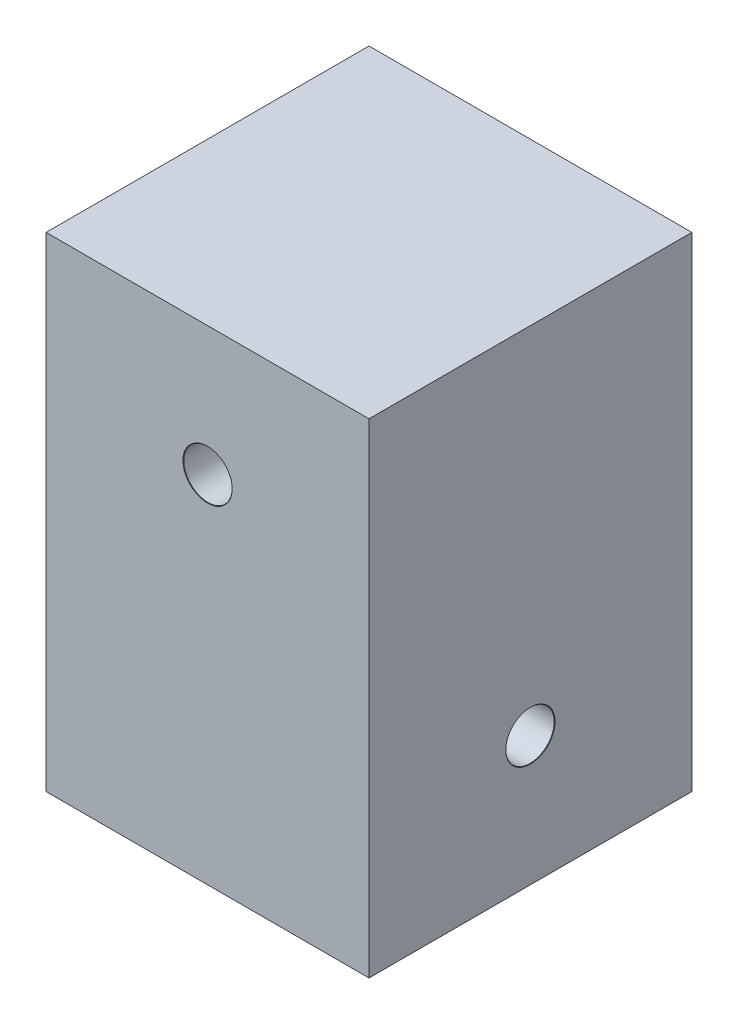
ISO-10303-21;
HEADER;
FILE_DESCRIPTION(('STEP AP214'),'2;1');
FILE_NAME('part.step','',(''),(''),'','','');
FILE_SCHEMA(('AUTOMOTIVE_DESIGN { 1 0 10303 214 1 1 1 1 }'));
ENDSEC;
DATA;
#1=APPLICATION_CONTEXT('core data for automotive mechanical design processes');
#2=APPLICATION_PROTOCOL_DEFINITION('international standard','automotive_design',2000,#1);
#3=PRODUCT_CONTEXT('',#1,'mechanical');
#4=PRODUCT('Part','Part','',(#3));
#5=PRODUCT_RELATED_PRODUCT_CATEGORY('part','',(#4));
#6=PRODUCT_DEFINITION_FORMATION('','',#4);
#7=PRODUCT_DEFINITION_CONTEXT('part definition',#1,'design');
#8=PRODUCT_DEFINITION('design','',#6,#7);
#9=PRODUCT_DEFINITION_SHAPE('','',#8);
#10=(LENGTH_UNIT() NAMED_UNIT(*) SI_UNIT(.MILLI.,.METRE.));
#11=(NAMED_UNIT(*) PLANE_ANGLE_UNIT() SI_UNIT($,.RADIAN.));
#12=(NAMED_UNIT(*) SI_UNIT($,.STERADIAN.) SOLID_ANGLE_UNIT());
#13=UNCERTAINTY_MEASURE_WITH_UNIT(LENGTH_MEASURE(1.E-05),#10,'distance_accuracy_value','');
#14=(GEOMETRIC_REPRESENTATION_CONTEXT(3) GLOBAL_UNCERTAINTY_ASSIGNED_CONTEXT((#13)) GLOBAL_UNIT_ASSIGNED_CONTEXT((#10,
#11,#12)) REPRESENTATION_CONTEXT('',''));
#15=CARTESIAN_POINT('',(0.,0.,0.));
#16=DIRECTION('',(0.,0.,1.));
#17=DIRECTION('',(1.,0.,0.));
#18=AXIS2_PLACEMENT_3D('',#15,#16,#17);
#19=CARTESIAN_POINT('',(0.,30.,0.));
#20=DIRECTION('',(1.,0.,0.));
#21=DIRECTION('',(0.,0.,-1.));
#22=AXIS2_PLACEMENT_3D('',#19,#20,#21);
#23=PLANE('',#22);
#24=CARTESIAN_POINT('',(0.,8.,10.));
#25=DIRECTION('',(1.,0.,0.));
#26=DIRECTION('',(0.,0.,-1.));
#27=AXIS2_PLACEMENT_3D('',#24,#25,#26);
#28=CIRCLE('',#27,1.49999999999999);
#29=CARTESIAN_POINT('',(0.,8.,8.50000000000001));
#30=VERTEX_POINT('',#29);
#31=EDGE_CURVE('E99',#30,#30,#28,.T.);
#32=ORIENTED_EDGE('',*,*,#31,.T.);
#33=EDGE_LOOP('',(#32));
#34=FACE_BOUND('',#33,.T.);
#35=DIRECTION('',(0.,0.,1.));
#36=VECTOR('',#35,1.);
#37=CARTESIAN_POINT('',(0.,0.,0.));
#38=LINE('',#37,#36);
#39=CARTESIAN_POINT('',(0.,0.,0.));
#40=VERTEX_POINT('',#39);
#41=CARTESIAN_POINT('',(0.,0.,20.));
#42=VERTEX_POINT('',#41);
#43=EDGE_CURVE('E96',#40,#42,#38,.T.);
#44=ORIENTED_EDGE('',*,*,#43,.T.);
#45=DIRECTION('',(0.,-1.,0.));
#46=VECTOR('',#45,1.);
#47=CARTESIAN_POINT('',(0.,30.,20.));
#48=LINE('',#47,#46);
#49=CARTESIAN_POINT('',(0.,30.,20.));
#50=VERTEX_POINT('',#49);
#51=EDGE_CURVE('E11',#50,#42,#48,.T.);
#52=ORIENTED_EDGE('',*,*,#51,.F.);
#53=DIRECTION('',(0.,0.,1.));
#54=VECTOR('',#53,1.);
#55=CARTESIAN_POINT('',(0.,30.,0.));
#56=LINE('',#55,#54);
#57=CARTESIAN_POINT('',(0.,30.,0.));
#58=VERTEX_POINT('',#57);
#59=EDGE_CURVE('E84',#58,#50,#56,.T.);
#60=ORIENTED_EDGE('',*,*,#59,.F.);
#61=DIRECTION('',(0.,-1.,0.));
#62=VECTOR('',#61,1.);
#63=CARTESIAN_POINT('',(0.,30.,0.));
#64=LINE('',#63,#62);
#65=EDGE_CURVE('E92',#58,#40,#64,.T.);
#66=ORIENTED_EDGE('',*,*,#65,.T.);
#67=EDGE_LOOP('',(#44,#52,#60,#66));
#68=FACE_BOUND('',#67,.T.);
#69=ADVANCED_FACE('F33',(#34,#68),#23,.F.);
#70=CARTESIAN_POINT('',(0.,30.,20.));
#71=DIRECTION('',(0.,0.,-1.));
#72=DIRECTION('',(-1.,0.,0.));
#73=AXIS2_PLACEMENT_3D('',#70,#71,#72);
#74=PLANE('',#73);
#75=CARTESIAN_POINT('',(10.,22.,20.));
#76=DIRECTION('',(0.,0.,1.));
#77=DIRECTION('',(1.,0.,0.));
#78=AXIS2_PLACEMENT_3D('',#75,#76,#77);
#79=CIRCLE('',#78,1.525);
#80=CARTESIAN_POINT('',(11.525,22.,20.));
#81=VERTEX_POINT('',#80);
#82=EDGE_CURVE('E124',#81,#81,#79,.T.);
#83=ORIENTED_EDGE('',*,*,#82,.F.);
#84=EDGE_LOOP('',(#83));
#85=FACE_BOUND('',#84,.T.);
#86=DIRECTION('',(1.,0.,0.));
#87=VECTOR('',#86,1.);
#88=CARTESIAN_POINT('',(0.,0.,20.));
#89=LINE('',#88,#87);
#90=CARTESIAN_POINT('',(20.,0.,20.));
#91=VERTEX_POINT('',#90);
#92=EDGE_CURVE('E88',#42,#91,#89,.T.);
#93=ORIENTED_EDGE('',*,*,#92,.T.);
#94=DIRECTION('',(0.,-1.,0.));
#95=VECTOR('',#94,1.);
#96=CARTESIAN_POINT('',(20.,30.,20.));
#97=LINE('',#96,#95);
#98=CARTESIAN_POINT('',(20.,30.,20.));
#99=VERTEX_POINT('',#98);
#100=EDGE_CURVE('E41',#99,#91,#97,.T.);
#101=ORIENTED_EDGE('',*,*,#100,.F.);
#102=DIRECTION('',(1.,0.,0.));
#103=VECTOR('',#102,1.);
#104=CARTESIAN_POINT('',(0.,30.,20.));
#105=LINE('',#104,#103);
#106=EDGE_CURVE('E79',#50,#99,#105,.T.);
#107=ORIENTED_EDGE('',*,*,#106,.F.);
#108=ORIENTED_EDGE('',*,*,#51,.T.);
#109=EDGE_LOOP('',(#93,#101,#107,#108));
#110=FACE_BOUND('',#109,.T.);
#111=ADVANCED_FACE('F87',(#85,#110),#74,.F.);
#112=CARTESIAN_POINT('',(20.,30.,0.));
#113=DIRECTION('',(-1.,0.,0.));
#114=DIRECTION('',(0.,0.,1.));
#115=AXIS2_PLACEMENT_3D('',#112,#113,#114);
#116=PLANE('',#115);
#117=CARTESIAN_POINT('',(20.,8.,10.));
#118=DIRECTION('',(1.,0.,0.));
#119=DIRECTION('',(0.,0.,-1.));
#120=AXIS2_PLACEMENT_3D('',#117,#118,#119);
#121=CIRCLE('',#120,1.525);
#122=CARTESIAN_POINT('',(20.,8.,8.475));
#123=VERTEX_POINT('',#122);
#124=EDGE_CURVE('E115',#123,#123,#121,.T.);
#125=ORIENTED_EDGE('',*,*,#124,.F.);
#126=EDGE_LOOP('',(#125));
#127=FACE_BOUND('',#126,.T.);
#128=DIRECTION('',(0.,0.,-1.));
#129=VECTOR('',#128,1.);
#130=CARTESIAN_POINT('',(20.,0.,0.));
#131=LINE('',#130,#129);
#132=CARTESIAN_POINT('',(20.,0.,0.));
#133=VERTEX_POINT('',#132);
#134=EDGE_CURVE('E66',#91,#133,#131,.T.);
#135=ORIENTED_EDGE('',*,*,#134,.T.);
#136=DIRECTION('',(0.,-1.,0.));
#137=VECTOR('',#136,1.);
#138=CARTESIAN_POINT('',(20.,30.,0.));
#139=LINE('',#138,#137);
#140=CARTESIAN_POINT('',(20.,30.,0.));
#141=VERTEX_POINT('',#140);
#142=EDGE_CURVE('E89',#141,#133,#139,.T.);
#143=ORIENTED_EDGE('',*,*,#142,.F.);
#144=DIRECTION('',(0.,0.,-1.));
#145=VECTOR('',#144,1.);
#146=CARTESIAN_POINT('',(20.,30.,0.));
#147=LINE('',#146,#145);
#148=EDGE_CURVE('E82',#99,#141,#147,.T.);
#149=ORIENTED_EDGE('',*,*,#148,.F.);
#150=ORIENTED_EDGE('',*,*,#100,.T.);
#151=EDGE_LOOP('',(#135,#143,#149,#150));
#152=FACE_BOUND('',#151,.T.);
#153=ADVANCED_FACE('F90',(#127,#152),#116,.F.);
#154=CARTESIAN_POINT('',(0.,30.,0.));
#155=DIRECTION('',(0.,0.,1.));
#156=DIRECTION('',(1.,0.,0.));
#157=AXIS2_PLACEMENT_3D('',#154,#155,#156);
#158=PLANE('',#157);
#159=CARTESIAN_POINT('',(10.,22.,0.));
#160=DIRECTION('',(0.,0.,1.));
#161=DIRECTION('',(1.,0.,0.));
#162=AXIS2_PLACEMENT_3D('',#159,#160,#161);
#163=CIRCLE('',#162,1.49999999999999);
#164=CARTESIAN_POINT('',(11.5,22.,0.));
#165=VERTEX_POINT('',#164);
#166=EDGE_CURVE('E118',#165,#165,#163,.T.);
#167=ORIENTED_EDGE('',*,*,#166,.T.);
#168=EDGE_LOOP('',(#167));
#169=FACE_BOUND('',#168,.T.);
#170=DIRECTION('',(-1.,0.,0.));
#171=VECTOR('',#170,1.);
#172=CARTESIAN_POINT('',(0.,0.,0.));
#173=LINE('',#172,#171);
#174=EDGE_CURVE('E72',#133,#40,#173,.T.);
#175=ORIENTED_EDGE('',*,*,#174,.T.);
#176=ORIENTED_EDGE('',*,*,#65,.F.);
#177=DIRECTION('',(-1.,0.,0.));
#178=VECTOR('',#177,1.);
#179=CARTESIAN_POINT('',(0.,30.,0.));
#180=LINE('',#179,#178);
#181=EDGE_CURVE('E49',#141,#58,#180,.T.);
#182=ORIENTED_EDGE('',*,*,#181,.F.);
#183=ORIENTED_EDGE('',*,*,#142,.T.);
#184=EDGE_LOOP('',(#175,#176,#182,#183));
#185=FACE_BOUND('',#184,.T.);
#186=ADVANCED_FACE('F104',(#169,#185),#158,.F.);
#187=CARTESIAN_POINT('',(0.,30.,0.));
#188=DIRECTION('',(0.,1.,0.));
#189=DIRECTION('',(0.,0.,1.));
#190=AXIS2_PLACEMENT_3D('',#187,#188,#189);
#191=PLANE('',#190);
#192=ORIENTED_EDGE('',*,*,#59,.T.);
#193=ORIENTED_EDGE('',*,*,#106,.T.);
#194=ORIENTED_EDGE('',*,*,#148,.T.);
#195=ORIENTED_EDGE('',*,*,#181,.T.);
#196=EDGE_LOOP('',(#192,#193,#194,#195));
#197=FACE_BOUND('',#196,.T.);
#198=ADVANCED_FACE('F80',(#197),#191,.T.);
#199=CARTESIAN_POINT('',(0.,0.,0.));
#200=DIRECTION('',(0.,1.,0.));
#201=DIRECTION('',(0.,0.,1.));
#202=AXIS2_PLACEMENT_3D('',#199,#200,#201);
#203=PLANE('',#202);
#204=ORIENTED_EDGE('',*,*,#43,.F.);
#205=ORIENTED_EDGE('',*,*,#174,.F.);
#206=ORIENTED_EDGE('',*,*,#134,.F.);
#207=ORIENTED_EDGE('',*,*,#92,.F.);
#208=EDGE_LOOP('',(#204,#205,#206,#207));
#209=FACE_BOUND('',#208,.T.);
#210=ADVANCED_FACE('F107',(#209),#203,.F.);
#211=CARTESIAN_POINT('',(20.,8.,10.));
#212=DIRECTION('',(1.,0.,0.));
#213=DIRECTION('',(0.,0.,-1.));
#214=AXIS2_PLACEMENT_3D('',#211,#212,#213);
#215=CYLINDRICAL_SURFACE('',#214,1.49999999999999);
#216=ORIENTED_EDGE('',*,*,#31,.F.);
#217=EDGE_LOOP('',(#216));
#218=FACE_BOUND('',#217,.T.);
#219=CARTESIAN_POINT('',(19.975,8.,10.));
#220=DIRECTION('',(1.,0.,0.));
#221=DIRECTION('',(0.,0.,-1.));
#222=AXIS2_PLACEMENT_3D('',#219,#220,#221);
#223=CIRCLE('',#222,1.49999999999999);
#224=CARTESIAN_POINT('',(19.975,8.,8.50000000000001));
#225=VERTEX_POINT('',#224);
#226=EDGE_CURVE('E112',#225,#225,#223,.T.);
#227=ORIENTED_EDGE('',*,*,#226,.T.);
#228=EDGE_LOOP('',(#227));
#229=FACE_BOUND('',#228,.T.);
#230=ADVANCED_FACE('F144',(#218,#229),#215,.F.);
#231=CARTESIAN_POINT('',(20.,8.,10.));
#232=DIRECTION('',(1.,0.,0.));
#233=DIRECTION('',(0.,0.,-1.));
#234=AXIS2_PLACEMENT_3D('',#231,#232,#233);
#235=CONICAL_SURFACE('',#234,1.525,0.785398163397379);
#236=ORIENTED_EDGE('',*,*,#226,.F.);
#237=EDGE_LOOP('',(#236));
#238=FACE_BOUND('',#237,.T.);
#239=ORIENTED_EDGE('',*,*,#124,.T.);
#240=EDGE_LOOP('',(#239));
#241=FACE_BOUND('',#240,.T.);
#242=ADVANCED_FACE('F149',(#238,#241),#235,.F.);
#243=CARTESIAN_POINT('',(10.,22.,20.));
#244=DIRECTION('',(0.,0.,1.));
#245=DIRECTION('',(1.,0.,0.));
#246=AXIS2_PLACEMENT_3D('',#243,#244,#245);
#247=CYLINDRICAL_SURFACE('',#246,1.49999999999999);
#248=ORIENTED_EDGE('',*,*,#166,.F.);
#249=EDGE_LOOP('',(#248));
#250=FACE_BOUND('',#249,.T.);
#251=CARTESIAN_POINT('',(10.,22.,19.975));
#252=DIRECTION('',(0.,0.,1.));
#253=DIRECTION('',(1.,0.,0.));
#254=AXIS2_PLACEMENT_3D('',#251,#252,#253);
#255=CIRCLE('',#254,1.49999999999999);
#256=CARTESIAN_POINT('',(11.5,22.,19.975));
#257=VERTEX_POINT('',#256);
#258=EDGE_CURVE('E121',#257,#257,#255,.T.);
#259=ORIENTED_EDGE('',*,*,#258,.T.);
#260=EDGE_LOOP('',(#259));
#261=FACE_BOUND('',#260,.T.);
#262=ADVANCED_FACE('F153',(#250,#261),#247,.F.);
#263=CARTESIAN_POINT('',(10.,22.,20.));
#264=DIRECTION('',(0.,0.,1.));
#265=DIRECTION('',(1.,0.,0.));
#266=AXIS2_PLACEMENT_3D('',#263,#264,#265);
#267=CONICAL_SURFACE('',#266,1.525,0.785398163397379);
#268=ORIENTED_EDGE('',*,*,#258,.F.);
#269=EDGE_LOOP('',(#268));
#270=FACE_BOUND('',#269,.T.);
#271=ORIENTED_EDGE('',*,*,#82,.T.);
#272=EDGE_LOOP('',(#271));
#273=FACE_BOUND('',#272,.T.);
#274=ADVANCED_FACE('F128',(#270,#273),#267,.F.);
#275=CLOSED_SHELL('',(#69,#111,#153,#186,#198,#210,#230,#242,#262,#274));
#276=MANIFOLD_SOLID_BREP('B2',#275);
#277=ADVANCED_BREP_SHAPE_REPRESENTATION('',(#18,#276),#14);
#278=SHAPE_DEFINITION_REPRESENTATION(#9,#277);
ENDSEC;
END-ISO-10303-21;
